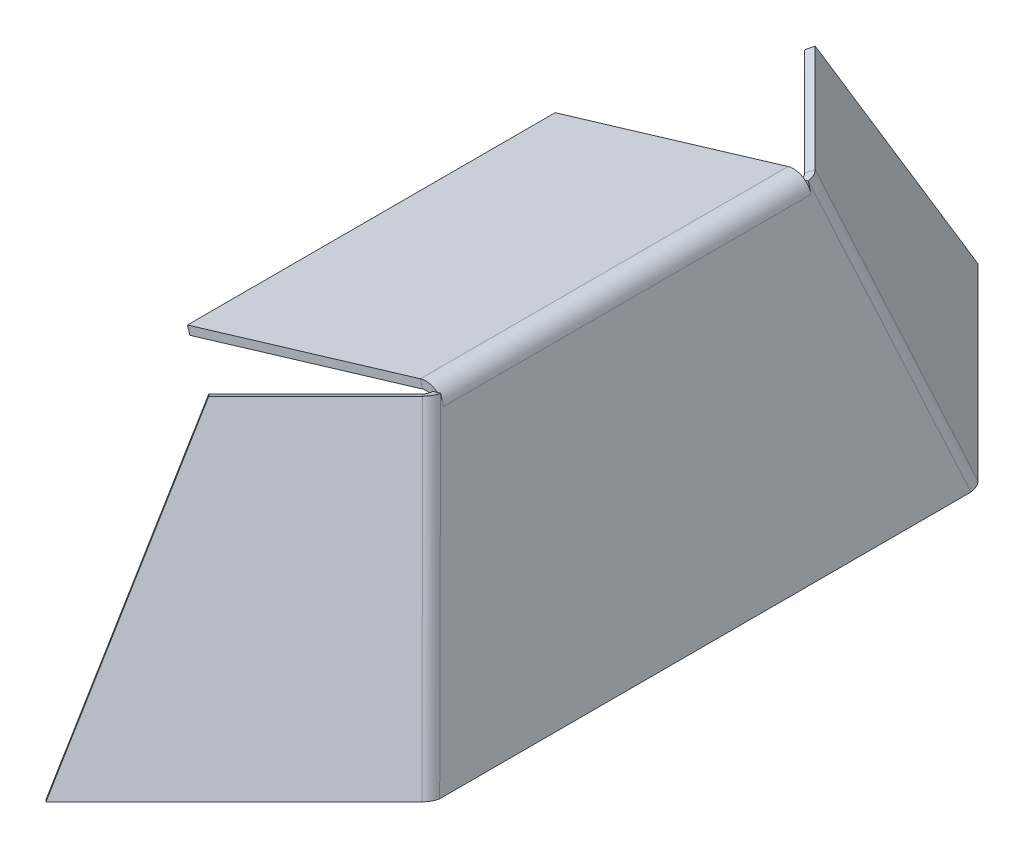
ISO-10303-21;
HEADER;
FILE_DESCRIPTION(('STEP AP214'),'2;1');
FILE_NAME('part.step','',(''),(''),'','','');
FILE_SCHEMA(('AUTOMOTIVE_DESIGN { 1 0 10303 214 1 1 1 1 }'));
ENDSEC;
DATA;
#1=APPLICATION_CONTEXT('core data for automotive mechanical design processes');
#2=APPLICATION_PROTOCOL_DEFINITION('international standard','automotive_design',2000,#1);
#3=PRODUCT_CONTEXT('',#1,'mechanical');
#4=PRODUCT('Part','Part','',(#3));
#5=PRODUCT_RELATED_PRODUCT_CATEGORY('part','',(#4));
#6=PRODUCT_DEFINITION_FORMATION('','',#4);
#7=PRODUCT_DEFINITION_CONTEXT('part definition',#1,'design');
#8=PRODUCT_DEFINITION('design','',#6,#7);
#9=PRODUCT_DEFINITION_SHAPE('','',#8);
#10=(LENGTH_UNIT() NAMED_UNIT(*) SI_UNIT(.MILLI.,.METRE.));
#11=(NAMED_UNIT(*) PLANE_ANGLE_UNIT() SI_UNIT($,.RADIAN.));
#12=(NAMED_UNIT(*) SI_UNIT($,.STERADIAN.) SOLID_ANGLE_UNIT());
#13=UNCERTAINTY_MEASURE_WITH_UNIT(LENGTH_MEASURE(1.E-05),#10,'distance_accuracy_value','');
#14=(GEOMETRIC_REPRESENTATION_CONTEXT(3) GLOBAL_UNCERTAINTY_ASSIGNED_CONTEXT((#13)) GLOBAL_UNIT_ASSIGNED_CONTEXT((#10,
#11,#12)) REPRESENTATION_CONTEXT('',''));
#15=CARTESIAN_POINT('',(0.,0.,0.));
#16=DIRECTION('',(0.,0.,1.));
#17=DIRECTION('',(1.,0.,0.));
#18=AXIS2_PLACEMENT_3D('',#15,#16,#17);
#19=CARTESIAN_POINT('',(40.7106781186552,100.,-68.1108104906525));
#20=DIRECTION('',(0.,0.,1.));
#21=DIRECTION('',(0.,-1.,0.));
#22=AXIS2_PLACEMENT_3D('',#19,#20,#21);
#23=PLANE('',#22);
#24=DIRECTION('',(0.957826285221151,0.287347885566345,0.));
#25=VECTOR('',#24,1.);
#26=CARTESIAN_POINT('',(40.7106781186552,100.,-68.1108104906525));
#27=LINE('',#26,#25);
#28=CARTESIAN_POINT('',(42.4271984016312,100.514956084893,-68.1108104906525));
#29=VERTEX_POINT('',#28);
#30=CARTESIAN_POINT('',(43.5841569743186,100.862043656699,-68.1108104906525));
#31=VERTEX_POINT('',#30);
#32=EDGE_CURVE('E58',#29,#31,#27,.T.);
#33=ORIENTED_EDGE('',*,*,#32,.F.);
#34=CARTESIAN_POINT('',(38.0958123600015,95.1438207339288,-68.1108104906525));
#35=DIRECTION('',(0.,0.,-1.));
#36=DIRECTION('',(-1.,0.,0.));
#37=AXIS2_PLACEMENT_3D('',#34,#35,#36);
#38=CIRCLE('',#37,6.89999999999999);
#39=CARTESIAN_POINT('',(44.7048137280274,97.1265211443366,-68.1108104906525));
#40=VERTEX_POINT('',#39);
#41=EDGE_CURVE('E11',#29,#40,#38,.T.);
#42=ORIENTED_EDGE('',*,*,#41,.T.);
#43=DIRECTION('',(-0.287347885566345,0.957826285221152,0.));
#44=VECTOR('',#43,1.);
#45=CARTESIAN_POINT('',(67.7456606158977,20.3236981847688,-68.1108104906519));
#46=LINE('',#45,#44);
#47=EDGE_CURVE('E229',#40,#31,#46,.T.);
#48=ORIENTED_EDGE('',*,*,#47,.T.);
#49=EDGE_LOOP('',(#33,#42,#48));
#50=FACE_BOUND('',#49,.T.);
#51=ADVANCED_FACE('F39',(#50),#23,.T.);
#52=CARTESIAN_POINT('',(41.8313348723639,96.2644774876376,68.110810490653));
#53=DIRECTION('',(0.,0.,-1.));
#54=DIRECTION('',(-1.,0.,0.));
#55=AXIS2_PLACEMENT_3D('',#52,#53,#54);
#56=PLANE('',#55);
#57=DIRECTION('',(0.287347885566345,-0.957826285221152,0.));
#58=VECTOR('',#57,1.);
#59=CARTESIAN_POINT('',(67.7456606158975,20.3236981847692,68.110810490653));
#60=LINE('',#59,#58);
#61=CARTESIAN_POINT('',(43.5841569743186,100.862043656699,68.110810490653));
#62=VERTEX_POINT('',#61);
#63=CARTESIAN_POINT('',(44.7048137280274,97.1265211443366,68.110810490653));
#64=VERTEX_POINT('',#63);
#65=EDGE_CURVE('E233',#62,#64,#60,.T.);
#66=ORIENTED_EDGE('',*,*,#65,.T.);
#67=CARTESIAN_POINT('',(38.0958123600015,95.1438207339288,68.110810490653));
#68=DIRECTION('',(0.,0.,-1.));
#69=DIRECTION('',(-1.,0.,0.));
#70=AXIS2_PLACEMENT_3D('',#67,#68,#69);
#71=CIRCLE('',#70,6.89999999999999);
#72=CARTESIAN_POINT('',(42.4271984016312,100.514956084893,68.110810490653));
#73=VERTEX_POINT('',#72);
#74=EDGE_CURVE('E66',#64,#73,#71,.F.);
#75=ORIENTED_EDGE('',*,*,#74,.T.);
#76=DIRECTION('',(0.957826285221151,0.287347885566346,0.));
#77=VECTOR('',#76,1.);
#78=CARTESIAN_POINT('',(40.7106781186552,100.,68.110810490653));
#79=LINE('',#78,#77);
#80=EDGE_CURVE('E331',#73,#62,#79,.T.);
#81=ORIENTED_EDGE('',*,*,#80,.T.);
#82=EDGE_LOOP('',(#66,#75,#81));
#83=FACE_BOUND('',#82,.T.);
#84=ADVANCED_FACE('F438',(#83),#56,.T.);
#85=CARTESIAN_POINT('',(67.7456606158975,20.3236981847692,0.));
#86=DIRECTION('',(-0.957826285221151,-0.287347885566345,0.));
#87=DIRECTION('',(0.287347885566345,-0.957826285221152,0.));
#88=AXIS2_PLACEMENT_3D('',#85,#86,#87);
#89=PLANE('',#88);
#90=ORIENTED_EDGE('',*,*,#47,.F.);
#91=DIRECTION('',(0.,0.,-1.));
#92=VECTOR('',#91,1.);
#93=CARTESIAN_POINT('',(44.7048137280274,97.1265211443366,-68.1108104906525));
#94=LINE('',#93,#92);
#95=EDGE_CURVE('E211',#40,#64,#94,.F.);
#96=ORIENTED_EDGE('',*,*,#95,.T.);
#97=ORIENTED_EDGE('',*,*,#65,.F.);
#98=DIRECTION('',(-0.275957697237864,0.919858990792882,-0.278759370053592));
#99=VECTOR('',#98,1.);
#100=CARTESIAN_POINT('',(60.6286696471801,44.0470014138274,85.3283683377961));
#101=LINE('',#100,#99);
#102=CARTESIAN_POINT('',(73.5841569743186,0.862043656699034,98.4153868272187));
#103=VERTEX_POINT('',#102);
#104=EDGE_CURVE('E239',#62,#103,#101,.F.);
#105=ORIENTED_EDGE('',*,*,#104,.T.);
#106=DIRECTION('',(0.,0.,1.));
#107=VECTOR('',#106,1.);
#108=CARTESIAN_POINT('',(73.5841569743186,0.862043656699018,0.));
#109=LINE('',#108,#107);
#110=CARTESIAN_POINT('',(73.5841569743186,0.862043656699024,-98.4153868272186));
#111=VERTEX_POINT('',#110);
#112=EDGE_CURVE('E255',#111,#103,#109,.T.);
#113=ORIENTED_EDGE('',*,*,#112,.F.);
#114=DIRECTION('',(-0.275957697237864,0.919858990792881,0.278759370053595));
#115=VECTOR('',#114,1.);
#116=CARTESIAN_POINT('',(60.6286696471801,44.0470014138276,-85.3283683377958));
#117=LINE('',#116,#115);
#118=EDGE_CURVE('E243',#111,#31,#117,.T.);
#119=ORIENTED_EDGE('',*,*,#118,.T.);
#120=EDGE_LOOP('',(#90,#96,#97,#105,#113,#119));
#121=FACE_BOUND('',#120,.T.);
#122=ADVANCED_FACE('F361',(#121),#89,.F.);
#123=CARTESIAN_POINT('',(64.8721817602341,19.4616545280702,0.));
#124=DIRECTION('',(-0.957826285221151,-0.287347885566345,0.));
#125=DIRECTION('',(0.287347885566345,-0.957826285221152,0.));
#126=AXIS2_PLACEMENT_3D('',#123,#124,#125);
#127=PLANE('',#126);
#128=DIRECTION('',(0.,0.,-1.));
#129=VECTOR('',#128,1.);
#130=CARTESIAN_POINT('',(41.8313348723639,96.2644774876376,-68.1108104906525));
#131=LINE('',#130,#129);
#132=CARTESIAN_POINT('',(41.8313348723639,96.2644774876376,-68.1108104906525));
#133=VERTEX_POINT('',#132);
#134=CARTESIAN_POINT('',(41.8313348723639,96.2644774876376,68.110810490653));
#135=VERTEX_POINT('',#134);
#136=EDGE_CURVE('E221',#133,#135,#131,.F.);
#137=ORIENTED_EDGE('',*,*,#136,.F.);
#138=DIRECTION('',(0.287347885566343,-0.957826285221152,0.));
#139=VECTOR('',#138,1.);
#140=CARTESIAN_POINT('',(40.7106781186552,100.,-68.1108104906525));
#141=LINE('',#140,#139);
#142=CARTESIAN_POINT('',(40.7106781186552,100.,-68.1108104906525));
#143=VERTEX_POINT('',#142);
#144=EDGE_CURVE('E226',#143,#133,#141,.T.);
#145=ORIENTED_EDGE('',*,*,#144,.F.);
#146=DIRECTION('',(-0.275957697237864,0.919858990792881,0.278759370053595));
#147=VECTOR('',#146,1.);
#148=CARTESIAN_POINT('',(57.7551907915166,43.1849577571286,-85.3283683377958));
#149=LINE('',#148,#147);
#150=CARTESIAN_POINT('',(70.7106781186552,0.,-98.4153868272186));
#151=VERTEX_POINT('',#150);
#152=EDGE_CURVE('E310',#151,#143,#149,.T.);
#153=ORIENTED_EDGE('',*,*,#152,.F.);
#154=DIRECTION('',(0.,0.,1.));
#155=VECTOR('',#154,1.);
#156=CARTESIAN_POINT('',(70.7106781186552,0.,-100.));
#157=LINE('',#156,#155);
#158=CARTESIAN_POINT('',(70.7106781186552,0.,98.4153868272187));
#159=VERTEX_POINT('',#158);
#160=EDGE_CURVE('E286',#151,#159,#157,.T.);
#161=ORIENTED_EDGE('',*,*,#160,.T.);
#162=DIRECTION('',(-0.275957697237864,0.919858990792882,-0.278759370053592));
#163=VECTOR('',#162,1.);
#164=CARTESIAN_POINT('',(57.7551907915166,43.1849577571283,85.3283683377961));
#165=LINE('',#164,#163);
#166=CARTESIAN_POINT('',(40.7106781186552,100.,68.110810490653));
#167=VERTEX_POINT('',#166);
#168=EDGE_CURVE('E307',#167,#159,#165,.F.);
#169=ORIENTED_EDGE('',*,*,#168,.F.);
#170=DIRECTION('',(-0.287347885566343,0.957826285221152,0.));
#171=VECTOR('',#170,1.);
#172=CARTESIAN_POINT('',(41.8313348723639,96.2644774876376,68.110810490653));
#173=LINE('',#172,#171);
#174=EDGE_CURVE('E215',#135,#167,#173,.T.);
#175=ORIENTED_EDGE('',*,*,#174,.F.);
#176=EDGE_LOOP('',(#137,#145,#153,#161,#169,#175));
#177=FACE_BOUND('',#176,.T.);
#178=ADVANCED_FACE('F387',(#177),#127,.T.);
#179=CARTESIAN_POINT('',(70.7106781186552,0.,-100.));
#180=DIRECTION('',(0.287347885566345,-0.957826285221152,0.));
#181=DIRECTION('',(0.,0.,1.));
#182=AXIS2_PLACEMENT_3D('',#179,#180,#181);
#183=PLANE('',#182);
#184=DIRECTION('',(0.957826285221151,0.287347885566345,0.));
#185=VECTOR('',#184,1.);
#186=CARTESIAN_POINT('',(70.7106781186552,0.,98.4153868272187));
#187=LINE('',#186,#185);
#188=EDGE_CURVE('E50',#159,#103,#187,.T.);
#189=ORIENTED_EDGE('',*,*,#188,.F.);
#190=ORIENTED_EDGE('',*,*,#160,.F.);
#191=DIRECTION('',(0.957826285221152,0.287347885566342,0.));
#192=VECTOR('',#191,1.);
#193=CARTESIAN_POINT('',(70.7106781186552,0.,-98.4153868272186));
#194=LINE('',#193,#192);
#195=EDGE_CURVE('E345',#151,#111,#194,.T.);
#196=ORIENTED_EDGE('',*,*,#195,.T.);
#197=ORIENTED_EDGE('',*,*,#112,.T.);
#198=EDGE_LOOP('',(#189,#190,#196,#197));
#199=FACE_BOUND('',#198,.T.);
#200=ADVANCED_FACE('F356',(#199),#183,.T.);
#201=CARTESIAN_POINT('',(61.7147254826752,-1.17674760824805,-93.1015499524074));
#202=CARTESIAN_POINT('',(62.3618706319923,-0.784498405498703,-93.7552652716847));
#203=CARTESIAN_POINT('',(63.0090157813094,-0.392249202749351,-94.408980590962));
#204=CARTESIAN_POINT('',(63.6561609306266,0.,-95.0626959102393));
#205=CARTESIAN_POINT('',(71.5219584350332,-1.17674760824806,-83.3928846570033));
#206=CARTESIAN_POINT('',(70.747765475313,-0.784498405498705,-85.4536529176436));
#207=CARTESIAN_POINT('',(69.9735725155927,-0.392249202749352,-87.5144211782838));
#208=CARTESIAN_POINT('',(69.1993795558724,0.,-89.575189438924));
#209=CARTESIAN_POINT('',(81.3704246300429,1.17674760824805,-93.3413378438288));
#210=CARTESIAN_POINT('',(79.3019413716885,0.784498405498701,-94.0946754659144));
#211=CARTESIAN_POINT('',(77.2334581133339,0.39224920274935,-94.848013088));
#212=CARTESIAN_POINT('',(75.1649748549794,0.,-95.6013507100855));
#213=CARTESIAN_POINT('',(71.5631916776849,1.17674760824805,-103.050003139233));
#214=CARTESIAN_POINT('',(70.9160465283678,0.784498405498703,-102.396287819955));
#215=CARTESIAN_POINT('',(70.2689013790507,0.392249202749351,-101.742572500678));
#216=CARTESIAN_POINT('',(69.6217562297335,0.,-101.088857181401));
#217=CARTESIAN_POINT('',(61.7559587253269,1.17674760824806,-112.758668434637));
#218=CARTESIAN_POINT('',(62.5301516850472,0.784498405498705,-110.697900173997));
#219=CARTESIAN_POINT('',(63.3043446447674,0.392249202749352,-108.637131913356));
#220=CARTESIAN_POINT('',(64.0785376044877,0.,-106.576363652716));
#221=CARTESIAN_POINT('',(51.9074925303172,-1.17674760824805,-102.810215247811));
#222=CARTESIAN_POINT('',(53.9759757886717,-0.784498405498701,-102.056877625726));
#223=CARTESIAN_POINT('',(56.0444590470262,-0.39224920274935,-101.30354000364));
#224=CARTESIAN_POINT('',(58.1129423053807,0.,-100.550202381555));
#225=CARTESIAN_POINT('',(61.7147254826752,-1.17674760824805,-93.1015499524074));
#226=CARTESIAN_POINT('',(62.3618706319923,-0.784498405498703,-93.7552652716847));
#227=CARTESIAN_POINT('',(63.0090157813094,-0.392249202749351,-94.408980590962));
#228=CARTESIAN_POINT('',(63.6561609306266,0.,-95.0626959102393));
#229=(BOUNDED_SURFACE() B_SPLINE_SURFACE(3,3,((#201,#202,#203,#204),(#205,#206,#207,#208),(#209,
#210,#211,#212),(#213,#214,#215,#216),(#217,#218,#219,#220),(#221,#222,#223,#224),(#225,#226,
#227,#228)),.UNSPECIFIED.,.T.,.F.,.F.) B_SPLINE_SURFACE_WITH_KNOTS((4,3,4),(4,4),(0.,0.5,1.),
(0.,1.),.UNSPECIFIED.) GEOMETRIC_REPRESENTATION_ITEM() RATIONAL_B_SPLINE_SURFACE(((1.,1.,1.,1.),
(0.333333333333333,0.333333333333333,0.333333333333333,0.333333333333333),(0.333333333333333,
0.333333333333333,0.333333333333333,0.333333333333333),(1.,1.,1.,1.),(0.333333333333333,
0.333333333333333,0.333333333333333,0.333333333333333),(0.333333333333333,0.333333333333333,
0.333333333333333,0.333333333333333),(1.,1.,1.,1.))) REPRESENTATION_ITEM('') SURFACE());
#230=CARTESIAN_POINT('',(66.6389585801801,0.,-98.0757765458201));
#231=DIRECTION('',(0.,-1.,0.));
#232=DIRECTION('',(-0.703526470681451,0.,0.710669054518699));
#233=AXIS2_PLACEMENT_3D('',#230,#231,#232);
#234=ELLIPSE('',#233,4.23978026962411,3.9);
#235=CARTESIAN_POINT('',(69.6346004400577,0.,-101.076077678597));
#236=VERTEX_POINT('',#235);
#237=EDGE_CURVE('E314',#151,#236,#234,.F.);
#238=DIRECTION('',(0.650439806512077,0.39224496964149,-0.650439806512085));
#239=VECTOR('',#238,1.);
#240=CARTESIAN_POINT('',(69.6346004400577,0.,-101.076077678597));
#241=LINE('',#240,#239);
#242=CARTESIAN_POINT('',(71.585919859594,1.17673490892448,-103.027397098134));
#243=VERTEX_POINT('',#242);
#244=EDGE_CURVE('E343',#236,#243,#241,.T.);
#245=CARTESIAN_POINT('',(66.6389585801801,0.,-98.0757765458201));
#246=DIRECTION('',(0.116641490775722,-0.986160163134628,-0.117825698707458));
#247=DIRECTION('',(-0.69378977909675,-0.165795454238901,0.700833510738891));
#248=AXIS2_PLACEMENT_3D('',#245,#246,#247);
#249=ELLIPSE('',#248,7.097586683845,6.9);
#250=EDGE_CURVE('E262',#111,#243,#249,.F.);
#251=ORIENTED_EDGE('',*,*,#195,.F.);
#252=ORIENTED_EDGE('',*,*,#237,.T.);
#253=ORIENTED_EDGE('',*,*,#244,.T.);
#254=ORIENTED_EDGE('',*,*,#250,.F.);
#255=EDGE_LOOP('',(#251,#252,#253,#254));
#256=FACE_BOUND('',#255,.T.);
#257=ADVANCED_FACE('F394',(#256),#229,.F.);
#258=CARTESIAN_POINT('',(0.,0.,-170.710678118654));
#259=DIRECTION('',(0.277359077919808,-0.919860795876717,-0.277359077919811));
#260=DIRECTION('',(0.707106781186552,0.,0.707106781186543));
#261=AXIS2_PLACEMENT_3D('',#258,#259,#260);
#262=PLANE('',#261);
#263=ORIENTED_EDGE('',*,*,#244,.F.);
#264=DIRECTION('',(0.707106781186552,0.,0.707106781186543));
#265=VECTOR('',#264,1.);
#266=CARTESIAN_POINT('',(0.,0.,-170.710678118654));
#267=LINE('',#266,#265);
#268=CARTESIAN_POINT('',(0.,0.,-170.710678118654));
#269=VERTEX_POINT('',#268);
#270=EDGE_CURVE('E296',#269,#236,#267,.T.);
#271=ORIENTED_EDGE('',*,*,#270,.F.);
#272=DIRECTION('',(0.650439806512077,0.39224496964149,-0.650439806512085));
#273=VECTOR('',#272,1.);
#274=CARTESIAN_POINT('',(0.,0.,-170.710678118654));
#275=LINE('',#274,#273);
#276=CARTESIAN_POINT('',(1.95131941953618,1.17673490892448,-172.661997538191));
#277=VERTEX_POINT('',#276);
#278=EDGE_CURVE('E341',#269,#277,#275,.T.);
#279=ORIENTED_EDGE('',*,*,#278,.T.);
#280=DIRECTION('',(0.707106781186552,0.,0.707106781186543));
#281=VECTOR('',#280,1.);
#282=CARTESIAN_POINT('',(87.3066584788634,1.17673490892448,-87.3066584788645));
#283=LINE('',#282,#281);
#284=EDGE_CURVE('E273',#277,#243,#283,.T.);
#285=ORIENTED_EDGE('',*,*,#284,.T.);
#286=EDGE_LOOP('',(#263,#271,#279,#285));
#287=FACE_BOUND('',#286,.T.);
#288=ADVANCED_FACE('F505',(#287),#262,.T.);
#289=CARTESIAN_POINT('',(0.,0.,-170.710678118654));
#290=DIRECTION('',(0.759557804320732,-0.335895096736065,0.556997689298742));
#291=DIRECTION('',(0.,0.856340100532269,0.516412269626102));
#292=AXIS2_PLACEMENT_3D('',#289,#290,#291);
#293=PLANE('',#292);
#294=ORIENTED_EDGE('',*,*,#278,.F.);
#295=DIRECTION('',(0.,0.856340100532269,0.516412269626102));
#296=VECTOR('',#295,1.);
#297=CARTESIAN_POINT('',(0.,0.,-170.710678118654));
#298=LINE('',#297,#296);
#299=CARTESIAN_POINT('',(0.,100.,-110.406101782089));
#300=VERTEX_POINT('',#299);
#301=EDGE_CURVE('E299',#269,#300,#298,.T.);
#302=ORIENTED_EDGE('',*,*,#301,.T.);
#303=DIRECTION('',(0.650439806512077,0.39224496964149,-0.650439806512085));
#304=VECTOR('',#303,1.);
#305=CARTESIAN_POINT('',(0.,100.,-110.406101782089));
#306=LINE('',#305,#304);
#307=CARTESIAN_POINT('',(1.95131941953607,101.176734908924,-112.357421201625));
#308=VERTEX_POINT('',#307);
#309=EDGE_CURVE('E339',#300,#308,#306,.T.);
#310=ORIENTED_EDGE('',*,*,#309,.T.);
#311=DIRECTION('',(0.,0.856340100532269,0.516412269626102));
#312=VECTOR('',#311,1.);
#313=CARTESIAN_POINT('',(1.95131941953619,1.17673490892447,-172.661997538191));
#314=LINE('',#313,#312);
#315=EDGE_CURVE('E270',#277,#308,#314,.T.);
#316=ORIENTED_EDGE('',*,*,#315,.F.);
#317=EDGE_LOOP('',(#294,#302,#310,#316));
#318=FACE_BOUND('',#317,.T.);
#319=ADVANCED_FACE('F501',(#318),#293,.F.);
#320=CARTESIAN_POINT('',(0.,100.,-110.406101782089));
#321=DIRECTION('',(0.277359077919809,-0.919860795876717,-0.27735907791981));
#322=DIRECTION('',(0.707106781186548,0.,0.707106781186547));
#323=AXIS2_PLACEMENT_3D('',#320,#321,#322);
#324=PLANE('',#323);
#325=ORIENTED_EDGE('',*,*,#309,.F.);
#326=DIRECTION('',(0.707106781186548,0.,0.707106781186547));
#327=VECTOR('',#326,1.);
#328=CARTESIAN_POINT('',(0.,100.,-110.406101782089));
#329=LINE('',#328,#327);
#330=CARTESIAN_POINT('',(39.6346004400578,100.,-70.7715013420314));
#331=VERTEX_POINT('',#330);
#332=EDGE_CURVE('E295',#300,#331,#329,.T.);
#333=ORIENTED_EDGE('',*,*,#332,.T.);
#334=DIRECTION('',(0.650439806512075,0.392244969641498,-0.650439806512083));
#335=VECTOR('',#334,1.);
#336=CARTESIAN_POINT('',(39.6346004400578,100.,-70.7715013420314));
#337=LINE('',#336,#335);
#338=CARTESIAN_POINT('',(41.585919859594,101.176734908924,-72.7228207615676));
#339=VERTEX_POINT('',#338);
#340=EDGE_CURVE('E337',#331,#339,#337,.T.);
#341=ORIENTED_EDGE('',*,*,#340,.T.);
#342=DIRECTION('',(0.707106781186552,0.,0.707106781186543));
#343=VECTOR('',#342,1.);
#344=CARTESIAN_POINT('',(57.1543703105806,101.176734908924,-57.1543703105813));
#345=LINE('',#344,#343);
#346=EDGE_CURVE('E267',#308,#339,#345,.T.);
#347=ORIENTED_EDGE('',*,*,#346,.F.);
#348=EDGE_LOOP('',(#325,#333,#341,#347));
#349=FACE_BOUND('',#348,.T.);
#350=ADVANCED_FACE('F492',(#349),#324,.F.);
#351=CARTESIAN_POINT('',(31.7147254826752,98.8232523917519,-62.7969736158413));
#352=CARTESIAN_POINT('',(32.3618706319924,99.2155015945013,-63.4506889351186));
#353=CARTESIAN_POINT('',(33.0090157813095,99.6077507972506,-64.1044042543959));
#354=CARTESIAN_POINT('',(33.6561609306266,100.,-64.7581195736732));
#355=CARTESIAN_POINT('',(21.9074925303172,98.8232523917519,-72.5056389112453));
#356=CARTESIAN_POINT('',(23.9759757886717,99.2155015945013,-71.7523012891597));
#357=CARTESIAN_POINT('',(26.0444590470262,99.6077507972507,-70.9989636670741));
#358=CARTESIAN_POINT('',(28.1129423053807,100.,-70.2456260449885));
#359=CARTESIAN_POINT('',(31.7559587253269,101.176747608248,-82.4540920980707));
#360=CARTESIAN_POINT('',(32.5301516850472,100.784498405499,-80.3933238374305));
#361=CARTESIAN_POINT('',(33.3043446447675,100.392249202749,-78.3325555767903));
#362=CARTESIAN_POINT('',(34.0785376044877,100.,-76.2717873161501));
#363=CARTESIAN_POINT('',(41.5631916776849,101.176747608248,-72.7454268026667));
#364=CARTESIAN_POINT('',(40.9160465283678,100.784498405499,-72.0917114833894));
#365=CARTESIAN_POINT('',(40.2689013790507,100.392249202749,-71.4379961641121));
#366=CARTESIAN_POINT('',(39.6217562297336,100.,-70.7842808448348));
#367=CARTESIAN_POINT('',(51.370424630043,101.176747608248,-63.0367615072626));
#368=CARTESIAN_POINT('',(49.3019413716885,100.784498405499,-63.7900991293483));
#369=CARTESIAN_POINT('',(47.233458113334,100.392249202749,-64.5434367514339));
#370=CARTESIAN_POINT('',(45.1649748549794,100.,-65.2967743735195));
#371=CARTESIAN_POINT('',(41.5219584350333,98.8232523917519,-53.0883083204373));
#372=CARTESIAN_POINT('',(40.747765475313,99.2155015945013,-55.1490765810775));
#373=CARTESIAN_POINT('',(39.9735725155927,99.6077507972507,-57.2098448417177));
#374=CARTESIAN_POINT('',(39.1993795558724,100.,-59.2706131023579));
#375=CARTESIAN_POINT('',(31.7147254826752,98.8232523917519,-62.7969736158413));
#376=CARTESIAN_POINT('',(32.3618706319924,99.2155015945013,-63.4506889351186));
#377=CARTESIAN_POINT('',(33.0090157813095,99.6077507972506,-64.1044042543959));
#378=CARTESIAN_POINT('',(33.6561609306266,100.,-64.7581195736732));
#379=(BOUNDED_SURFACE() B_SPLINE_SURFACE(3,3,((#351,#352,#353,#354),(#355,#356,#357,#358),(#359,
#360,#361,#362),(#363,#364,#365,#366),(#367,#368,#369,#370),(#371,#372,#373,#374),(#375,#376,
#377,#378)),.UNSPECIFIED.,.T.,.F.,.F.) B_SPLINE_SURFACE_WITH_KNOTS((4,3,4),(4,4),(0.,0.5,1.),
(0.,1.),.UNSPECIFIED.) GEOMETRIC_REPRESENTATION_ITEM() RATIONAL_B_SPLINE_SURFACE(((1.,1.,1.,1.),
(0.333333333333333,0.333333333333333,0.333333333333333,0.333333333333333),(0.333333333333333,
0.333333333333333,0.333333333333333,0.333333333333333),(1.,1.,1.,1.),(0.333333333333333,
0.333333333333333,0.333333333333333,0.333333333333333),(0.333333333333333,0.333333333333333,
0.333333333333333,0.333333333333333),(1.,1.,1.,1.))) REPRESENTATION_ITEM('') SURFACE());
#380=CARTESIAN_POINT('',(36.6389585801801,100.,-67.771200209254));
#381=DIRECTION('',(0.,1.,0.));
#382=DIRECTION('',(-0.703526470681451,0.,0.710669054518699));
#383=AXIS2_PLACEMENT_3D('',#380,#381,#382);
#384=ELLIPSE('',#383,4.23978026962411,3.9);
#385=EDGE_CURVE('E235',#331,#143,#384,.F.);
#386=EDGE_CURVE('E335',#143,#29,#27,.T.);
#387=CARTESIAN_POINT('',(36.6389585801801,100.,-67.771200209254));
#388=DIRECTION('',(-0.116641490775723,0.986160163134628,0.117825698707459));
#389=DIRECTION('',(-0.693789779096749,-0.165795454238902,0.700833510738892));
#390=AXIS2_PLACEMENT_3D('',#387,#388,#389);
#391=ELLIPSE('',#390,7.097586683845,6.9);
#392=EDGE_CURVE('E263',#339,#31,#391,.F.);
#393=ORIENTED_EDGE('',*,*,#340,.F.);
#394=ORIENTED_EDGE('',*,*,#385,.T.);
#395=ORIENTED_EDGE('',*,*,#386,.T.);
#396=ORIENTED_EDGE('',*,*,#32,.T.);
#397=ORIENTED_EDGE('',*,*,#392,.F.);
#398=EDGE_LOOP('',(#393,#394,#395,#396,#397));
#399=FACE_BOUND('',#398,.T.);
#400=ADVANCED_FACE('F482',(#399),#379,.F.);
#401=CARTESIAN_POINT('',(31.7147254826752,98.823252391752,62.7969736158418));
#402=CARTESIAN_POINT('',(32.3618706319923,99.2155015945013,63.4506889351191));
#403=CARTESIAN_POINT('',(33.0090157813094,99.6077507972507,64.1044042543964));
#404=CARTESIAN_POINT('',(33.6561609306265,100.,64.7581195736737));
#405=CARTESIAN_POINT('',(41.5219584350332,98.823252391752,53.0883083204377));
#406=CARTESIAN_POINT('',(40.7477654753129,99.2155015945013,55.1490765810779));
#407=CARTESIAN_POINT('',(39.9735725155926,99.6077507972506,57.2098448417181));
#408=CARTESIAN_POINT('',(39.1993795558723,100.,59.2706131023583));
#409=CARTESIAN_POINT('',(51.3704246300429,101.176747608248,63.036761507263));
#410=CARTESIAN_POINT('',(49.3019413716884,100.784498405499,63.7900991293487));
#411=CARTESIAN_POINT('',(47.2334581133339,100.392249202749,64.5434367514343));
#412=CARTESIAN_POINT('',(45.1649748549794,100.,65.2967743735199));
#413=CARTESIAN_POINT('',(41.5631916776849,101.176747608248,72.7454268026671));
#414=CARTESIAN_POINT('',(40.9160465283678,100.784498405499,72.0917114833898));
#415=CARTESIAN_POINT('',(40.2689013790507,100.392249202749,71.4379961641125));
#416=CARTESIAN_POINT('',(39.6217562297336,100.,70.7842808448352));
#417=CARTESIAN_POINT('',(31.755958725327,101.176747608248,82.4540920980712));
#418=CARTESIAN_POINT('',(32.5301516850472,100.784498405499,80.393323837431));
#419=CARTESIAN_POINT('',(33.3043446447675,100.392249202749,78.3325555767908));
#420=CARTESIAN_POINT('',(34.0785376044878,100.,76.2717873161506));
#421=CARTESIAN_POINT('',(21.9074925303172,98.823252391752,72.5056389112459));
#422=CARTESIAN_POINT('',(23.9759757886717,99.2155015945013,71.7523012891603));
#423=CARTESIAN_POINT('',(26.0444590470262,99.6077507972506,70.9989636670746));
#424=CARTESIAN_POINT('',(28.1129423053807,100.,70.245626044989));
#425=CARTESIAN_POINT('',(31.7147254826752,98.823252391752,62.7969736158418));
#426=CARTESIAN_POINT('',(32.3618706319923,99.2155015945013,63.4506889351191));
#427=CARTESIAN_POINT('',(33.0090157813094,99.6077507972507,64.1044042543964));
#428=CARTESIAN_POINT('',(33.6561609306265,100.,64.7581195736737));
#429=(BOUNDED_SURFACE() B_SPLINE_SURFACE(3,3,((#401,#402,#403,#404),(#405,#406,#407,#408),(#409,
#410,#411,#412),(#413,#414,#415,#416),(#417,#418,#419,#420),(#421,#422,#423,#424),(#425,#426,
#427,#428)),.UNSPECIFIED.,.T.,.F.,.F.) B_SPLINE_SURFACE_WITH_KNOTS((4,3,4),(4,4),(0.,0.5,1.),
(0.,1.),.UNSPECIFIED.) GEOMETRIC_REPRESENTATION_ITEM() RATIONAL_B_SPLINE_SURFACE(((1.,1.,1.,1.),
(0.333333333333333,0.333333333333333,0.333333333333333,0.333333333333333),(0.333333333333333,
0.333333333333333,0.333333333333333,0.333333333333333),(1.,1.,1.,1.),(0.333333333333333,
0.333333333333333,0.333333333333333,0.333333333333333),(0.333333333333333,0.333333333333333,
0.333333333333333,0.333333333333333),(1.,1.,1.,1.))) REPRESENTATION_ITEM('') SURFACE());
#430=EDGE_CURVE('E332',#167,#73,#79,.T.);
#431=CARTESIAN_POINT('',(36.6389585801801,100.,67.7712002092544));
#432=DIRECTION('',(0.,1.,0.));
#433=DIRECTION('',(-0.703526470681455,0.,-0.710669054518695));
#434=AXIS2_PLACEMENT_3D('',#431,#432,#433);
#435=ELLIPSE('',#434,4.2397802696241,3.9);
#436=CARTESIAN_POINT('',(39.6346004400575,100.,70.7715013420316));
#437=VERTEX_POINT('',#436);
#438=EDGE_CURVE('E311',#167,#437,#435,.F.);
#439=DIRECTION('',(0.650439806512078,0.392244969641488,0.650439806512085));
#440=VECTOR('',#439,1.);
#441=CARTESIAN_POINT('',(39.6346004400575,100.,70.7715013420316));
#442=LINE('',#441,#440);
#443=CARTESIAN_POINT('',(41.5859198595939,101.176734908925,72.722820761568));
#444=VERTEX_POINT('',#443);
#445=EDGE_CURVE('E329',#437,#444,#442,.T.);
#446=CARTESIAN_POINT('',(36.6389585801801,100.,67.7712002092544));
#447=DIRECTION('',(-0.116641490775721,0.986160163134629,-0.117825698707456));
#448=DIRECTION('',(-0.693789779096753,-0.165795454238899,-0.700833510738888));
#449=AXIS2_PLACEMENT_3D('',#446,#447,#448);
#450=ELLIPSE('',#449,7.097586683845,6.9);
#451=EDGE_CURVE('E258',#62,#444,#450,.F.);
#452=ORIENTED_EDGE('',*,*,#430,.F.);
#453=ORIENTED_EDGE('',*,*,#438,.T.);
#454=ORIENTED_EDGE('',*,*,#445,.T.);
#455=ORIENTED_EDGE('',*,*,#451,.F.);
#456=ORIENTED_EDGE('',*,*,#80,.F.);
#457=EDGE_LOOP('',(#452,#453,#454,#455,#456));
#458=FACE_BOUND('',#457,.T.);
#459=ADVANCED_FACE('F366',(#458),#429,.F.);
#460=CARTESIAN_POINT('',(40.7106781186552,100.,69.695423663434));
#461=DIRECTION('',(0.277359077919808,-0.919860795876718,0.277359077919808));
#462=DIRECTION('',(-0.707106781186548,0.,0.707106781186547));
#463=AXIS2_PLACEMENT_3D('',#460,#461,#462);
#464=PLANE('',#463);
#465=ORIENTED_EDGE('',*,*,#445,.F.);
#466=DIRECTION('',(-0.707106781186548,0.,0.707106781186547));
#467=VECTOR('',#466,1.);
#468=CARTESIAN_POINT('',(40.7106781186552,100.,69.695423663434));
#469=LINE('',#468,#467);
#470=CARTESIAN_POINT('',(0.,100.,110.406101782089));
#471=VERTEX_POINT('',#470);
#472=EDGE_CURVE('E289',#437,#471,#469,.T.);
#473=ORIENTED_EDGE('',*,*,#472,.T.);
#474=DIRECTION('',(0.650439806512078,0.392244969641488,0.650439806512085));
#475=VECTOR('',#474,1.);
#476=CARTESIAN_POINT('',(0.,100.,110.406101782089));
#477=LINE('',#476,#475);
#478=CARTESIAN_POINT('',(1.95131941953626,101.176734908924,112.357421201625));
#479=VERTEX_POINT('',#478);
#480=EDGE_CURVE('E327',#471,#479,#477,.T.);
#481=ORIENTED_EDGE('',*,*,#480,.T.);
#482=DIRECTION('',(-0.707106781186551,0.,0.707106781186544));
#483=VECTOR('',#482,1.);
#484=CARTESIAN_POINT('',(57.1543703105808,101.176734908925,57.1543703105814));
#485=LINE('',#484,#483);
#486=EDGE_CURVE('E240',#444,#479,#485,.T.);
#487=ORIENTED_EDGE('',*,*,#486,.F.);
#488=EDGE_LOOP('',(#465,#473,#481,#487));
#489=FACE_BOUND('',#488,.T.);
#490=ADVANCED_FACE('F369',(#489),#464,.F.);
#491=CARTESIAN_POINT('',(0.,100.,110.406101782089));
#492=DIRECTION('',(0.759557804320731,-0.335895096736066,-0.556997689298743));
#493=DIRECTION('',(0.,-0.856340100532269,0.516412269626103));
#494=AXIS2_PLACEMENT_3D('',#491,#492,#493);
#495=PLANE('',#494);
#496=ORIENTED_EDGE('',*,*,#480,.F.);
#497=DIRECTION('',(0.,-0.856340100532269,0.516412269626103));
#498=VECTOR('',#497,1.);
#499=CARTESIAN_POINT('',(0.,100.,110.406101782089));
#500=LINE('',#499,#498);
#501=CARTESIAN_POINT('',(0.,0.,170.710678118654));
#502=VERTEX_POINT('',#501);
#503=EDGE_CURVE('E282',#471,#502,#500,.T.);
#504=ORIENTED_EDGE('',*,*,#503,.T.);
#505=DIRECTION('',(0.650439806512078,0.392244969641488,0.650439806512085));
#506=VECTOR('',#505,1.);
#507=CARTESIAN_POINT('',(0.,0.,170.710678118654));
#508=LINE('',#507,#506);
#509=CARTESIAN_POINT('',(1.95131941953627,1.17673490892447,172.661997538191));
#510=VERTEX_POINT('',#509);
#511=EDGE_CURVE('E325',#502,#510,#508,.T.);
#512=ORIENTED_EDGE('',*,*,#511,.T.);
#513=DIRECTION('',(0.,-0.856340100532269,0.516412269626103));
#514=VECTOR('',#513,1.);
#515=CARTESIAN_POINT('',(1.95131941953625,101.176734908924,112.357421201625));
#516=LINE('',#515,#514);
#517=EDGE_CURVE('E252',#479,#510,#516,.T.);
#518=ORIENTED_EDGE('',*,*,#517,.F.);
#519=EDGE_LOOP('',(#496,#504,#512,#518));
#520=FACE_BOUND('',#519,.T.);
#521=ADVANCED_FACE('F472',(#520),#495,.F.);
#522=CARTESIAN_POINT('',(70.7106781186552,0.,100.));
#523=DIRECTION('',(0.277359077919806,-0.919860795876718,0.277359077919809));
#524=DIRECTION('',(-0.707106781186551,0.,0.707106781186544));
#525=AXIS2_PLACEMENT_3D('',#522,#523,#524);
#526=PLANE('',#525);
#527=ORIENTED_EDGE('',*,*,#511,.F.);
#528=DIRECTION('',(-0.707106781186551,0.,0.707106781186544));
#529=VECTOR('',#528,1.);
#530=CARTESIAN_POINT('',(70.7106781186552,0.,100.));
#531=LINE('',#530,#529);
#532=CARTESIAN_POINT('',(69.6346004400577,0.,101.076077678597));
#533=VERTEX_POINT('',#532);
#534=EDGE_CURVE('E285',#533,#502,#531,.T.);
#535=ORIENTED_EDGE('',*,*,#534,.F.);
#536=DIRECTION('',(0.650439806512079,0.392244969641487,0.650439806512084));
#537=VECTOR('',#536,1.);
#538=CARTESIAN_POINT('',(69.6346004400577,0.,101.076077678597));
#539=LINE('',#538,#537);
#540=CARTESIAN_POINT('',(71.5859198595939,1.17673490892447,103.027397098134));
#541=VERTEX_POINT('',#540);
#542=EDGE_CURVE('E45',#533,#541,#539,.T.);
#543=ORIENTED_EDGE('',*,*,#542,.T.);
#544=DIRECTION('',(-0.707106781186551,0.,0.707106781186544));
#545=VECTOR('',#544,1.);
#546=CARTESIAN_POINT('',(87.3066584788635,1.17673490892447,87.3066584788644));
#547=LINE('',#546,#545);
#548=EDGE_CURVE('E249',#541,#510,#547,.T.);
#549=ORIENTED_EDGE('',*,*,#548,.T.);
#550=EDGE_LOOP('',(#527,#535,#543,#549));
#551=FACE_BOUND('',#550,.T.);
#552=ADVANCED_FACE('F375',(#551),#526,.T.);
#553=CARTESIAN_POINT('',(61.7147254826751,-1.17674760824805,93.1015499524075));
#554=CARTESIAN_POINT('',(62.3618706319923,-0.784498405498699,93.7552652716848));
#555=CARTESIAN_POINT('',(63.0090157813094,-0.39224920274935,94.4089805909621));
#556=CARTESIAN_POINT('',(63.6561609306265,0.,95.0626959102394));
#557=CARTESIAN_POINT('',(51.9074925303172,-1.17674760824805,102.810215247812));
#558=CARTESIAN_POINT('',(53.9759757886717,-0.784498405498698,102.056877625726));
#559=CARTESIAN_POINT('',(56.0444590470262,-0.392249202749349,101.30354000364));
#560=CARTESIAN_POINT('',(58.1129423053807,0.,100.550202381555));
#561=CARTESIAN_POINT('',(61.7559587253269,1.17674760824805,112.758668434637));
#562=CARTESIAN_POINT('',(62.5301516850472,0.784498405498701,110.697900173997));
#563=CARTESIAN_POINT('',(63.3043446447675,0.392249202749351,108.637131913357));
#564=CARTESIAN_POINT('',(64.0785376044877,0.,106.576363652716));
#565=CARTESIAN_POINT('',(71.5631916776849,1.17674760824805,103.050003139233));
#566=CARTESIAN_POINT('',(70.9160465283678,0.784498405498699,102.396287819956));
#567=CARTESIAN_POINT('',(70.2689013790507,0.39224920274935,101.742572500678));
#568=CARTESIAN_POINT('',(69.6217562297335,0.,101.088857181401));
#569=CARTESIAN_POINT('',(81.3704246300429,1.17674760824805,93.3413378438287));
#570=CARTESIAN_POINT('',(79.3019413716884,0.784498405498697,94.0946754659143));
#571=CARTESIAN_POINT('',(77.2334581133339,0.392249202749349,94.8480130879999));
#572=CARTESIAN_POINT('',(75.1649748549793,0.,95.6013507100855));
#573=CARTESIAN_POINT('',(71.5219584350331,-1.17674760824805,83.3928846570034));
#574=CARTESIAN_POINT('',(70.7477654753129,-0.784498405498701,85.4536529176436));
#575=CARTESIAN_POINT('',(69.9735725155926,-0.392249202749351,87.5144211782838));
#576=CARTESIAN_POINT('',(69.1993795558723,0.,89.575189438924));
#577=CARTESIAN_POINT('',(61.7147254826751,-1.17674760824805,93.1015499524075));
#578=CARTESIAN_POINT('',(62.3618706319923,-0.784498405498699,93.7552652716848));
#579=CARTESIAN_POINT('',(63.0090157813094,-0.39224920274935,94.4089805909621));
#580=CARTESIAN_POINT('',(63.6561609306265,0.,95.0626959102394));
#581=(BOUNDED_SURFACE() B_SPLINE_SURFACE(3,3,((#553,#554,#555,#556),(#557,#558,#559,#560),(#561,
#562,#563,#564),(#565,#566,#567,#568),(#569,#570,#571,#572),(#573,#574,#575,#576),(#577,#578,
#579,#580)),.UNSPECIFIED.,.T.,.F.,.F.) B_SPLINE_SURFACE_WITH_KNOTS((4,3,4),(4,4),(0.,0.5,1.),
(0.,1.),.UNSPECIFIED.) GEOMETRIC_REPRESENTATION_ITEM() RATIONAL_B_SPLINE_SURFACE(((1.,1.,1.,1.),
(0.333333333333333,0.333333333333333,0.333333333333333,0.333333333333333),(0.333333333333333,
0.333333333333333,0.333333333333333,0.333333333333333),(1.,1.,1.,1.),(0.333333333333333,
0.333333333333333,0.333333333333333,0.333333333333333),(0.333333333333333,0.333333333333333,
0.333333333333333,0.333333333333333),(1.,1.,1.,1.))) REPRESENTATION_ITEM('') SURFACE());
#582=CARTESIAN_POINT('',(66.63895858018,0.,98.0757765458201));
#583=DIRECTION('',(0.,-1.,0.));
#584=DIRECTION('',(-0.703526470681455,0.,-0.710669054518695));
#585=AXIS2_PLACEMENT_3D('',#582,#583,#584);
#586=ELLIPSE('',#585,4.2397802696241,3.9);
#587=EDGE_CURVE('E300',#533,#159,#586,.F.);
#588=CARTESIAN_POINT('',(66.63895858018,0.,98.0757765458201));
#589=DIRECTION('',(0.116641490775722,-0.986160163134628,0.117825698707456));
#590=DIRECTION('',(-0.693789779096754,-0.1657954542389,-0.700833510738887));
#591=AXIS2_PLACEMENT_3D('',#588,#589,#590);
#592=ELLIPSE('',#591,7.09758668384499,6.9);
#593=EDGE_CURVE('E261',#541,#103,#592,.F.);
#594=ORIENTED_EDGE('',*,*,#587,.T.);
#595=ORIENTED_EDGE('',*,*,#188,.T.);
#596=ORIENTED_EDGE('',*,*,#593,.F.);
#597=ORIENTED_EDGE('',*,*,#542,.F.);
#598=EDGE_LOOP('',(#594,#595,#596,#597));
#599=FACE_BOUND('',#598,.T.);
#600=ADVANCED_FACE('F41',(#599),#581,.F.);
#601=CARTESIAN_POINT('',(74.1742175134886,44.7304476224722,74.1742175134894));
#602=DIRECTION('',(-0.650439806512078,-0.392244969641488,-0.650439806512085));
#603=DIRECTION('',(-0.707106781186551,0.,0.707106781186544));
#604=AXIS2_PLACEMENT_3D('',#601,#602,#603);
#605=PLANE('',#604);
#606=ORIENTED_EDGE('',*,*,#548,.F.);
#607=DIRECTION('',(-0.275957697237864,0.919858990792882,-0.278759370053592));
#608=VECTOR('',#607,1.);
#609=CARTESIAN_POINT('',(58.5077029440875,44.7707912939459,89.8164030027295));
#610=LINE('',#609,#608);
#611=EDGE_CURVE('E236',#541,#444,#610,.T.);
#612=ORIENTED_EDGE('',*,*,#611,.T.);
#613=ORIENTED_EDGE('',*,*,#486,.T.);
#614=ORIENTED_EDGE('',*,*,#517,.T.);
#615=EDGE_LOOP('',(#606,#612,#613,#614));
#616=FACE_BOUND('',#615,.T.);
#617=ADVANCED_FACE('F373',(#616),#605,.F.);
#618=CARTESIAN_POINT('',(74.1742175134884,44.7304476224724,-74.1742175134893));
#619=DIRECTION('',(-0.650439806512077,-0.39224496964149,0.650439806512085));
#620=DIRECTION('',(0.707106781186552,0.,0.707106781186543));
#621=AXIS2_PLACEMENT_3D('',#618,#619,#620);
#622=PLANE('',#621);
#623=ORIENTED_EDGE('',*,*,#346,.T.);
#624=DIRECTION('',(-0.275957697237864,0.919858990792881,0.278759370053595));
#625=VECTOR('',#624,1.);
#626=CARTESIAN_POINT('',(58.5077029440874,44.7707912939461,-89.8164030027292));
#627=LINE('',#626,#625);
#628=EDGE_CURVE('E246',#339,#243,#627,.F.);
#629=ORIENTED_EDGE('',*,*,#628,.T.);
#630=ORIENTED_EDGE('',*,*,#284,.F.);
#631=ORIENTED_EDGE('',*,*,#315,.T.);
#632=EDGE_LOOP('',(#623,#629,#630,#631));
#633=FACE_BOUND('',#632,.T.);
#634=ADVANCED_FACE('F448',(#633),#622,.F.);
#635=CARTESIAN_POINT('',(54.0196682791542,42.0643010034196,85.3283683377961));
#636=DIRECTION('',(-0.275957697237864,0.919858990792882,-0.278759370053592));
#637=DIRECTION('',(0.,0.290020946713694,0.95702029783453));
#638=AXIS2_PLACEMENT_3D('',#635,#636,#637);
#639=CYLINDRICAL_SURFACE('',#638,6.9);
#640=ORIENTED_EDGE('',*,*,#593,.T.);
#641=ORIENTED_EDGE('',*,*,#104,.F.);
#642=ORIENTED_EDGE('',*,*,#451,.T.);
#643=ORIENTED_EDGE('',*,*,#611,.F.);
#644=EDGE_LOOP('',(#640,#641,#642,#643));
#645=FACE_BOUND('',#644,.T.);
#646=ADVANCED_FACE('F354',(#645),#639,.T.);
#647=CARTESIAN_POINT('',(54.0196682791541,42.0643010034198,-85.3283683377958));
#648=DIRECTION('',(-0.275957697237864,0.919858990792881,0.278759370053595));
#649=DIRECTION('',(0.,-0.290020946713697,0.957020297834529));
#650=AXIS2_PLACEMENT_3D('',#647,#648,#649);
#651=CYLINDRICAL_SURFACE('',#650,6.9);
#652=ORIENTED_EDGE('',*,*,#250,.T.);
#653=ORIENTED_EDGE('',*,*,#628,.F.);
#654=ORIENTED_EDGE('',*,*,#392,.T.);
#655=ORIENTED_EDGE('',*,*,#118,.F.);
#656=EDGE_LOOP('',(#652,#653,#654,#655));
#657=FACE_BOUND('',#656,.T.);
#658=ADVANCED_FACE('F398',(#657),#651,.T.);
#659=CARTESIAN_POINT('',(72.2228980939524,43.5537127135477,72.2228980939531));
#660=DIRECTION('',(-0.650439806512078,-0.392244969641488,-0.650439806512085));
#661=DIRECTION('',(-0.707106781186551,0.,0.707106781186544));
#662=AXIS2_PLACEMENT_3D('',#659,#660,#661);
#663=PLANE('',#662);
#664=ORIENTED_EDGE('',*,*,#534,.T.);
#665=ORIENTED_EDGE('',*,*,#503,.F.);
#666=ORIENTED_EDGE('',*,*,#472,.F.);
#667=DIRECTION('',(-0.275957697237864,0.919858990792882,-0.278759370053592));
#668=VECTOR('',#667,1.);
#669=CARTESIAN_POINT('',(56.5563835245513,43.5940563850214,87.8650835831932));
#670=LINE('',#669,#668);
#671=EDGE_CURVE('E292',#533,#437,#670,.T.);
#672=ORIENTED_EDGE('',*,*,#671,.F.);
#673=EDGE_LOOP('',(#664,#665,#666,#672));
#674=FACE_BOUND('',#673,.T.);
#675=ADVANCED_FACE('F380',(#674),#663,.T.);
#676=CARTESIAN_POINT('',(72.2228980939521,43.553712713548,-72.222898093953));
#677=DIRECTION('',(-0.650439806512077,-0.39224496964149,0.650439806512085));
#678=DIRECTION('',(0.707106781186552,0.,0.707106781186543));
#679=AXIS2_PLACEMENT_3D('',#676,#677,#678);
#680=PLANE('',#679);
#681=ORIENTED_EDGE('',*,*,#332,.F.);
#682=ORIENTED_EDGE('',*,*,#301,.F.);
#683=ORIENTED_EDGE('',*,*,#270,.T.);
#684=DIRECTION('',(-0.275957697237864,0.919858990792881,0.278759370053595));
#685=VECTOR('',#684,1.);
#686=CARTESIAN_POINT('',(56.5563835245512,43.5940563850216,-87.8650835831929));
#687=LINE('',#686,#685);
#688=EDGE_CURVE('E266',#331,#236,#687,.F.);
#689=ORIENTED_EDGE('',*,*,#688,.F.);
#690=EDGE_LOOP('',(#681,#682,#683,#689));
#691=FACE_BOUND('',#690,.T.);
#692=ADVANCED_FACE('F460',(#691),#680,.T.);
#693=CARTESIAN_POINT('',(54.0196682791542,42.0643010034196,85.3283683377961));
#694=DIRECTION('',(-0.275957697237864,0.919858990792882,-0.278759370053592));
#695=DIRECTION('',(0.,0.290020946713694,0.95702029783453));
#696=AXIS2_PLACEMENT_3D('',#693,#694,#695);
#697=CYLINDRICAL_SURFACE('',#696,3.9);
#698=ORIENTED_EDGE('',*,*,#587,.F.);
#699=ORIENTED_EDGE('',*,*,#671,.T.);
#700=ORIENTED_EDGE('',*,*,#438,.F.);
#701=ORIENTED_EDGE('',*,*,#168,.T.);
#702=EDGE_LOOP('',(#698,#699,#700,#701));
#703=FACE_BOUND('',#702,.T.);
#704=ADVANCED_FACE('F383',(#703),#697,.F.);
#705=CARTESIAN_POINT('',(54.0196682791541,42.0643010034198,-85.3283683377958));
#706=DIRECTION('',(-0.275957697237864,0.919858990792881,0.278759370053595));
#707=DIRECTION('',(0.,-0.290020946713697,0.957020297834529));
#708=AXIS2_PLACEMENT_3D('',#705,#706,#707);
#709=CYLINDRICAL_SURFACE('',#708,3.9);
#710=ORIENTED_EDGE('',*,*,#237,.F.);
#711=ORIENTED_EDGE('',*,*,#152,.T.);
#712=ORIENTED_EDGE('',*,*,#385,.F.);
#713=ORIENTED_EDGE('',*,*,#688,.T.);
#714=EDGE_LOOP('',(#710,#711,#712,#713));
#715=FACE_BOUND('',#714,.T.);
#716=ADVANCED_FACE('F391',(#715),#709,.F.);
#717=CARTESIAN_POINT('',(38.0958123600015,95.1438207339288,-68.1108104906525));
#718=DIRECTION('',(0.,0.,1.));
#719=DIRECTION('',(1.,0.,0.));
#720=AXIS2_PLACEMENT_3D('',#717,#718,#719);
#721=PLANE('',#720);
#722=ORIENTED_EDGE('',*,*,#386,.F.);
#723=ORIENTED_EDGE('',*,*,#144,.T.);
#724=CARTESIAN_POINT('',(38.0958123600015,95.1438207339288,-68.1108104906525));
#725=DIRECTION('',(0.,0.,-1.));
#726=DIRECTION('',(-1.,0.,0.));
#727=AXIS2_PLACEMENT_3D('',#724,#725,#726);
#728=CIRCLE('',#727,3.89999999999999);
#729=CARTESIAN_POINT('',(36.9751556062927,98.8793432462913,-68.1108104906525));
#730=VERTEX_POINT('',#729);
#731=EDGE_CURVE('E209',#730,#133,#728,.T.);
#732=ORIENTED_EDGE('',*,*,#731,.F.);
#733=DIRECTION('',(-0.287347885566342,0.957826285221152,0.));
#734=VECTOR('',#733,1.);
#735=CARTESIAN_POINT('',(36.9751556062927,98.8793432462913,-68.1108104906525));
#736=LINE('',#735,#734);
#737=CARTESIAN_POINT('',(36.1131119495937,101.752822101955,-68.1108104906525));
#738=VERTEX_POINT('',#737);
#739=EDGE_CURVE('E418',#730,#738,#736,.T.);
#740=ORIENTED_EDGE('',*,*,#739,.T.);
#741=EDGE_CURVE('E52',#738,#29,#38,.T.);
#742=ORIENTED_EDGE('',*,*,#741,.T.);
#743=EDGE_LOOP('',(#722,#723,#732,#740,#742));
#744=FACE_BOUND('',#743,.T.);
#745=ADVANCED_FACE('F416',(#744),#721,.F.);
#746=CARTESIAN_POINT('',(38.0958123600015,95.1438207339288,68.110810490653));
#747=DIRECTION('',(0.,0.,1.));
#748=DIRECTION('',(1.,0.,0.));
#749=AXIS2_PLACEMENT_3D('',#746,#747,#748);
#750=PLANE('',#749);
#751=ORIENTED_EDGE('',*,*,#174,.T.);
#752=ORIENTED_EDGE('',*,*,#430,.T.);
#753=CARTESIAN_POINT('',(36.1131119495937,101.752822101955,68.110810490653));
#754=VERTEX_POINT('',#753);
#755=EDGE_CURVE('E214',#73,#754,#71,.F.);
#756=ORIENTED_EDGE('',*,*,#755,.T.);
#757=DIRECTION('',(-0.287347885566342,0.957826285221152,0.));
#758=VECTOR('',#757,1.);
#759=CARTESIAN_POINT('',(36.9751556062927,98.8793432462913,68.110810490653));
#760=LINE('',#759,#758);
#761=CARTESIAN_POINT('',(36.9751556062927,98.8793432462913,68.110810490653));
#762=VERTEX_POINT('',#761);
#763=EDGE_CURVE('E181',#762,#754,#760,.T.);
#764=ORIENTED_EDGE('',*,*,#763,.F.);
#765=CARTESIAN_POINT('',(38.0958123600015,95.1438207339288,68.110810490653));
#766=DIRECTION('',(0.,0.,-1.));
#767=DIRECTION('',(-1.,0.,0.));
#768=AXIS2_PLACEMENT_3D('',#765,#766,#767);
#769=CIRCLE('',#768,3.89999999999999);
#770=EDGE_CURVE('E218',#135,#762,#769,.F.);
#771=ORIENTED_EDGE('',*,*,#770,.F.);
#772=EDGE_LOOP('',(#751,#752,#756,#764,#771));
#773=FACE_BOUND('',#772,.T.);
#774=ADVANCED_FACE('F406',(#773),#750,.T.);
#775=CARTESIAN_POINT('',(38.0958123600015,95.1438207339288,-68.1108104906525));
#776=DIRECTION('',(0.,0.,-1.));
#777=DIRECTION('',(-0.287347885566342,0.957826285221153,0.));
#778=AXIS2_PLACEMENT_3D('',#775,#776,#777);
#779=CYLINDRICAL_SURFACE('',#778,6.89999999999999);
#780=ORIENTED_EDGE('',*,*,#95,.F.);
#781=ORIENTED_EDGE('',*,*,#41,.F.);
#782=ORIENTED_EDGE('',*,*,#741,.F.);
#783=DIRECTION('',(0.,0.,-1.));
#784=VECTOR('',#783,1.);
#785=CARTESIAN_POINT('',(36.1131119495937,101.752822101955,0.));
#786=LINE('',#785,#784);
#787=EDGE_CURVE('E205',#754,#738,#786,.T.);
#788=ORIENTED_EDGE('',*,*,#787,.F.);
#789=ORIENTED_EDGE('',*,*,#755,.F.);
#790=ORIENTED_EDGE('',*,*,#74,.F.);
#791=EDGE_LOOP('',(#780,#781,#782,#788,#789,#790));
#792=FACE_BOUND('',#791,.T.);
#793=ADVANCED_FACE('F402',(#792),#779,.T.);
#794=CARTESIAN_POINT('',(38.0958123600015,95.1438207339288,-68.1108104906525));
#795=DIRECTION('',(0.,0.,-1.));
#796=DIRECTION('',(-0.287347885566342,0.957826285221153,0.));
#797=AXIS2_PLACEMENT_3D('',#794,#795,#796);
#798=CYLINDRICAL_SURFACE('',#797,3.89999999999999);
#799=ORIENTED_EDGE('',*,*,#136,.T.);
#800=ORIENTED_EDGE('',*,*,#770,.T.);
#801=DIRECTION('',(0.,0.,-1.));
#802=VECTOR('',#801,1.);
#803=CARTESIAN_POINT('',(36.9751556062927,98.8793432462913,68.110810490653));
#804=LINE('',#803,#802);
#805=EDGE_CURVE('E412',#762,#730,#804,.T.);
#806=ORIENTED_EDGE('',*,*,#805,.T.);
#807=ORIENTED_EDGE('',*,*,#731,.T.);
#808=EDGE_LOOP('',(#799,#800,#806,#807));
#809=FACE_BOUND('',#808,.T.);
#810=ADVANCED_FACE('F409',(#809),#798,.F.);
#811=CARTESIAN_POINT('',(39.8486344619562,102.873478855664,-68.1108104906525));
#812=DIRECTION('',(0.,0.,-1.));
#813=DIRECTION('',(-1.,0.,0.));
#814=AXIS2_PLACEMENT_3D('',#811,#812,#813);
#815=PLANE('',#814);
#816=DIRECTION('',(0.957826285221153,0.287347885566342,0.));
#817=VECTOR('',#816,1.);
#818=CARTESIAN_POINT('',(39.8486344619562,102.873478855664,-68.1108104906525));
#819=LINE('',#818,#817);
#820=CARTESIAN_POINT('',(-50.1870363488321,75.8627776124274,-68.1108104906525));
#821=VERTEX_POINT('',#820);
#822=EDGE_CURVE('E195',#821,#738,#819,.T.);
#823=ORIENTED_EDGE('',*,*,#822,.T.);
#824=ORIENTED_EDGE('',*,*,#739,.F.);
#825=DIRECTION('',(0.957826285221153,0.287347885566342,0.));
#826=VECTOR('',#825,1.);
#827=CARTESIAN_POINT('',(40.7106781186552,100.,-68.1108104906525));
#828=LINE('',#827,#826);
#829=CARTESIAN_POINT('',(-49.3249926921331,72.9892987567639,-68.1108104906525));
#830=VERTEX_POINT('',#829);
#831=EDGE_CURVE('E186',#830,#730,#828,.T.);
#832=ORIENTED_EDGE('',*,*,#831,.F.);
#833=DIRECTION('',(0.287347885566342,-0.957826285221153,0.));
#834=VECTOR('',#833,1.);
#835=CARTESIAN_POINT('',(-50.1870363488321,75.8627776124274,-68.1108104906525));
#836=LINE('',#835,#834);
#837=EDGE_CURVE('E194',#821,#830,#836,.T.);
#838=ORIENTED_EDGE('',*,*,#837,.F.);
#839=EDGE_LOOP('',(#823,#824,#832,#838));
#840=FACE_BOUND('',#839,.T.);
#841=ADVANCED_FACE('F423',(#840),#815,.T.);
#842=CARTESIAN_POINT('',(-50.1870363488321,75.8627776124274,68.110810490653));
#843=DIRECTION('',(0.,0.,1.));
#844=DIRECTION('',(1.,0.,0.));
#845=AXIS2_PLACEMENT_3D('',#842,#843,#844);
#846=PLANE('',#845);
#847=DIRECTION('',(-0.957826285221153,-0.287347885566342,0.));
#848=VECTOR('',#847,1.);
#849=CARTESIAN_POINT('',(-49.3249926921331,72.9892987567639,68.110810490653));
#850=LINE('',#849,#848);
#851=CARTESIAN_POINT('',(-49.3249926921331,72.9892987567639,68.110810490653));
#852=VERTEX_POINT('',#851);
#853=EDGE_CURVE('E203',#762,#852,#850,.T.);
#854=ORIENTED_EDGE('',*,*,#853,.F.);
#855=ORIENTED_EDGE('',*,*,#763,.T.);
#856=DIRECTION('',(-0.957826285221153,-0.287347885566342,0.));
#857=VECTOR('',#856,1.);
#858=CARTESIAN_POINT('',(-50.1870363488321,75.8627776124274,68.110810490653));
#859=LINE('',#858,#857);
#860=CARTESIAN_POINT('',(-50.1870363488321,75.8627776124274,68.110810490653));
#861=VERTEX_POINT('',#860);
#862=EDGE_CURVE('E175',#754,#861,#859,.T.);
#863=ORIENTED_EDGE('',*,*,#862,.T.);
#864=DIRECTION('',(0.287347885566342,-0.957826285221153,0.));
#865=VECTOR('',#864,1.);
#866=CARTESIAN_POINT('',(-50.1870363488321,75.8627776124274,68.110810490653));
#867=LINE('',#866,#865);
#868=EDGE_CURVE('E179',#861,#852,#867,.T.);
#869=ORIENTED_EDGE('',*,*,#868,.T.);
#870=EDGE_LOOP('',(#854,#855,#863,#869));
#871=FACE_BOUND('',#870,.T.);
#872=ADVANCED_FACE('F178',(#871),#846,.T.);
#873=CARTESIAN_POINT('',(-25.0235472982777,83.4118243275936,0.));
#874=DIRECTION('',(-0.287347885566342,0.957826285221153,0.));
#875=DIRECTION('',(-0.957826285221153,-0.287347885566342,0.));
#876=AXIS2_PLACEMENT_3D('',#873,#874,#875);
#877=PLANE('',#876);
#878=ORIENTED_EDGE('',*,*,#862,.F.);
#879=ORIENTED_EDGE('',*,*,#787,.T.);
#880=ORIENTED_EDGE('',*,*,#822,.F.);
#881=DIRECTION('',(0.,0.,-1.));
#882=VECTOR('',#881,1.);
#883=CARTESIAN_POINT('',(-50.1870363488321,75.8627776124274,-68.1108104906525));
#884=LINE('',#883,#882);
#885=EDGE_CURVE('E185',#861,#821,#884,.T.);
#886=ORIENTED_EDGE('',*,*,#885,.F.);
#887=EDGE_LOOP('',(#878,#879,#880,#886));
#888=FACE_BOUND('',#887,.T.);
#889=ADVANCED_FACE('F197',(#888),#877,.T.);
#890=CARTESIAN_POINT('',(-24.1615036415787,80.5383454719302,0.));
#891=DIRECTION('',(-0.287347885566342,0.957826285221153,0.));
#892=DIRECTION('',(-0.957826285221153,-0.287347885566342,0.));
#893=AXIS2_PLACEMENT_3D('',#890,#891,#892);
#894=PLANE('',#893);
#895=ORIENTED_EDGE('',*,*,#805,.F.);
#896=ORIENTED_EDGE('',*,*,#853,.T.);
#897=DIRECTION('',(0.,0.,-1.));
#898=VECTOR('',#897,1.);
#899=CARTESIAN_POINT('',(-49.3249926921331,72.9892987567639,-68.1108104906525));
#900=LINE('',#899,#898);
#901=EDGE_CURVE('E193',#852,#830,#900,.T.);
#902=ORIENTED_EDGE('',*,*,#901,.T.);
#903=ORIENTED_EDGE('',*,*,#831,.T.);
#904=EDGE_LOOP('',(#895,#896,#902,#903));
#905=FACE_BOUND('',#904,.T.);
#906=ADVANCED_FACE('F421',(#905),#894,.F.);
#907=CARTESIAN_POINT('',(-50.1870363488321,75.8627776124274,-68.1108104906525));
#908=DIRECTION('',(-0.957826285221153,-0.287347885566342,0.));
#909=DIRECTION('',(0.287347885566342,-0.957826285221153,0.));
#910=AXIS2_PLACEMENT_3D('',#907,#908,#909);
#911=PLANE('',#910);
#912=ORIENTED_EDGE('',*,*,#901,.F.);
#913=ORIENTED_EDGE('',*,*,#868,.F.);
#914=ORIENTED_EDGE('',*,*,#885,.T.);
#915=ORIENTED_EDGE('',*,*,#837,.T.);
#916=EDGE_LOOP('',(#912,#913,#914,#915));
#917=FACE_BOUND('',#916,.T.);
#918=ADVANCED_FACE('F190',(#917),#911,.T.);
#919=CLOSED_SHELL('',(#51,#84,#122,#178,#200,#257,#288,#319,#350,#400,#459,#490,#521,#552,#600,
#617,#634,#646,#658,#675,#692,#704,#716,#745,#774,#793,#810,#841,#872,#889,#906,#918));
#920=MANIFOLD_SOLID_BREP('B2',#919);
#921=ADVANCED_BREP_SHAPE_REPRESENTATION('',(#18,#920),#14);
#922=SHAPE_DEFINITION_REPRESENTATION(#9,#921);
ENDSEC;
END-ISO-10303-21;
